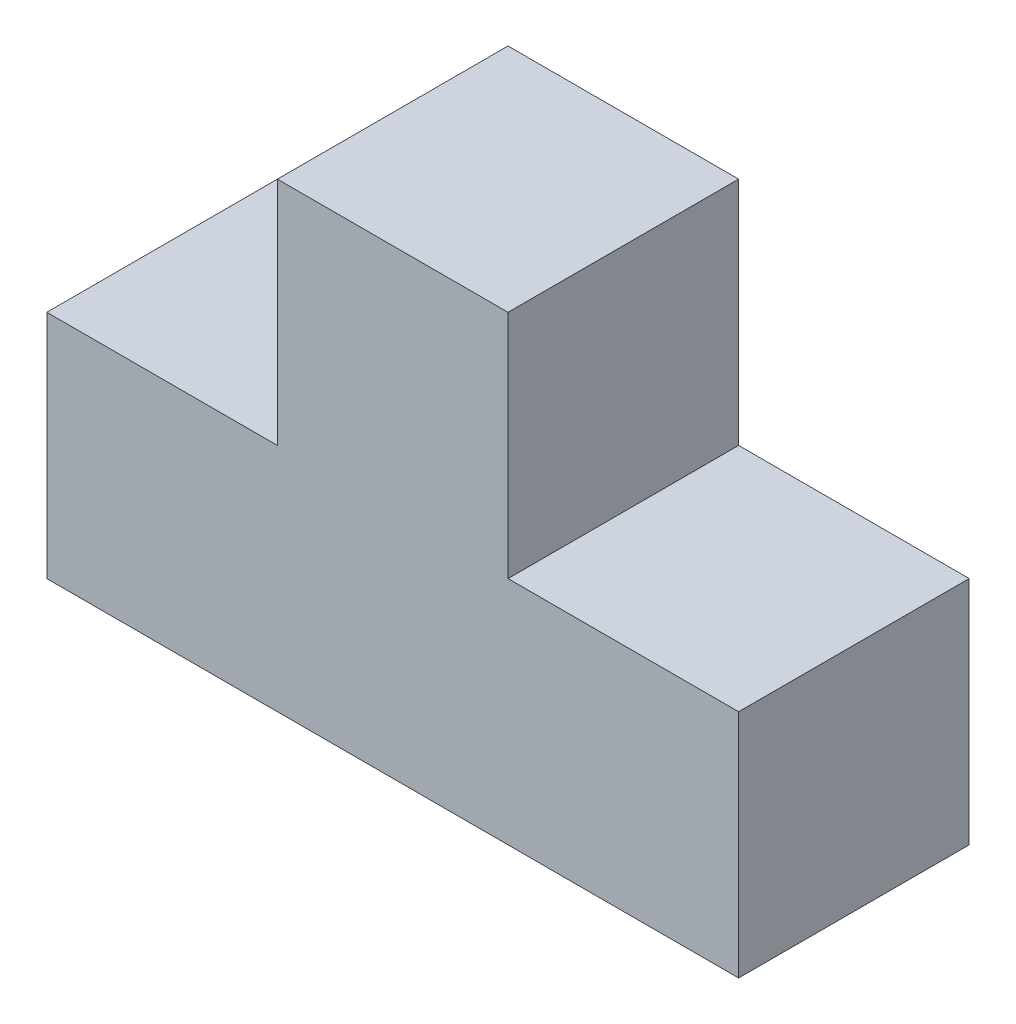
ISO-10303-21;
HEADER;
FILE_DESCRIPTION(('STEP AP214'),'2;1');
FILE_NAME('part.step','',(''),(''),'','','');
FILE_SCHEMA(('AUTOMOTIVE_DESIGN { 1 0 10303 214 1 1 1 1 }'));
ENDSEC;
DATA;
#1=APPLICATION_CONTEXT('core data for automotive mechanical design processes');
#2=APPLICATION_PROTOCOL_DEFINITION('international standard','automotive_design',2000,#1);
#3=PRODUCT_CONTEXT('',#1,'mechanical');
#4=PRODUCT('Part','Part','',(#3));
#5=PRODUCT_RELATED_PRODUCT_CATEGORY('part','',(#4));
#6=PRODUCT_DEFINITION_FORMATION('','',#4);
#7=PRODUCT_DEFINITION_CONTEXT('part definition',#1,'design');
#8=PRODUCT_DEFINITION('design','',#6,#7);
#9=PRODUCT_DEFINITION_SHAPE('','',#8);
#10=(LENGTH_UNIT() NAMED_UNIT(*) SI_UNIT(.MILLI.,.METRE.));
#11=(NAMED_UNIT(*) PLANE_ANGLE_UNIT() SI_UNIT($,.RADIAN.));
#12=(NAMED_UNIT(*) SI_UNIT($,.STERADIAN.) SOLID_ANGLE_UNIT());
#13=UNCERTAINTY_MEASURE_WITH_UNIT(LENGTH_MEASURE(1.E-05),#10,'distance_accuracy_value','');
#14=(GEOMETRIC_REPRESENTATION_CONTEXT(3) GLOBAL_UNCERTAINTY_ASSIGNED_CONTEXT((#13)) GLOBAL_UNIT_ASSIGNED_CONTEXT((#10,
#11,#12)) REPRESENTATION_CONTEXT('',''));
#15=CARTESIAN_POINT('',(0.,0.,0.));
#16=DIRECTION('',(0.,0.,1.));
#17=DIRECTION('',(1.,0.,0.));
#18=AXIS2_PLACEMENT_3D('',#15,#16,#17);
#19=CARTESIAN_POINT('',(0.,30.,30.));
#20=DIRECTION('',(1.,0.,0.));
#21=DIRECTION('',(0.,0.,-1.));
#22=AXIS2_PLACEMENT_3D('',#19,#20,#21);
#23=PLANE('',#22);
#24=DIRECTION('',(0.,-1.,0.));
#25=VECTOR('',#24,1.);
#26=CARTESIAN_POINT('',(0.,30.,0.));
#27=LINE('',#26,#25);
#28=CARTESIAN_POINT('',(0.,30.,0.));
#29=VERTEX_POINT('',#28);
#30=CARTESIAN_POINT('',(0.,0.,0.));
#31=VERTEX_POINT('',#30);
#32=EDGE_CURVE('E129',#29,#31,#27,.T.);
#33=ORIENTED_EDGE('',*,*,#32,.T.);
#34=DIRECTION('',(0.,0.,-1.));
#35=VECTOR('',#34,1.);
#36=CARTESIAN_POINT('',(0.,0.,30.));
#37=LINE('',#36,#35);
#38=CARTESIAN_POINT('',(0.,0.,30.));
#39=VERTEX_POINT('',#38);
#40=EDGE_CURVE('E11',#39,#31,#37,.T.);
#41=ORIENTED_EDGE('',*,*,#40,.F.);
#42=DIRECTION('',(0.,-1.,0.));
#43=VECTOR('',#42,1.);
#44=CARTESIAN_POINT('',(0.,30.,30.));
#45=LINE('',#44,#43);
#46=CARTESIAN_POINT('',(0.,30.,30.));
#47=VERTEX_POINT('',#46);
#48=EDGE_CURVE('E143',#47,#39,#45,.T.);
#49=ORIENTED_EDGE('',*,*,#48,.F.);
#50=DIRECTION('',(0.,0.,-1.));
#51=VECTOR('',#50,1.);
#52=CARTESIAN_POINT('',(0.,30.,30.));
#53=LINE('',#52,#51);
#54=EDGE_CURVE('E125',#47,#29,#53,.T.);
#55=ORIENTED_EDGE('',*,*,#54,.T.);
#56=EDGE_LOOP('',(#33,#41,#49,#55));
#57=FACE_BOUND('',#56,.T.);
#58=ADVANCED_FACE('F33',(#57),#23,.F.);
#59=CARTESIAN_POINT('',(0.,0.,30.));
#60=DIRECTION('',(0.,1.,0.));
#61=DIRECTION('',(0.,0.,1.));
#62=AXIS2_PLACEMENT_3D('',#59,#60,#61);
#63=PLANE('',#62);
#64=DIRECTION('',(1.,0.,0.));
#65=VECTOR('',#64,1.);
#66=CARTESIAN_POINT('',(0.,0.,0.));
#67=LINE('',#66,#65);
#68=CARTESIAN_POINT('',(90.,0.,0.));
#69=VERTEX_POINT('',#68);
#70=EDGE_CURVE('E132',#31,#69,#67,.T.);
#71=ORIENTED_EDGE('',*,*,#70,.T.);
#72=DIRECTION('',(0.,0.,-1.));
#73=VECTOR('',#72,1.);
#74=CARTESIAN_POINT('',(90.,0.,30.));
#75=LINE('',#74,#73);
#76=CARTESIAN_POINT('',(90.,0.,30.));
#77=VERTEX_POINT('',#76);
#78=EDGE_CURVE('E41',#77,#69,#75,.T.);
#79=ORIENTED_EDGE('',*,*,#78,.F.);
#80=DIRECTION('',(1.,0.,0.));
#81=VECTOR('',#80,1.);
#82=CARTESIAN_POINT('',(0.,0.,30.));
#83=LINE('',#82,#81);
#84=EDGE_CURVE('E92',#39,#77,#83,.T.);
#85=ORIENTED_EDGE('',*,*,#84,.F.);
#86=ORIENTED_EDGE('',*,*,#40,.T.);
#87=EDGE_LOOP('',(#71,#79,#85,#86));
#88=FACE_BOUND('',#87,.T.);
#89=ADVANCED_FACE('F178',(#88),#63,.F.);
#90=CARTESIAN_POINT('',(90.,0.,30.));
#91=DIRECTION('',(-1.,0.,0.));
#92=DIRECTION('',(0.,0.,1.));
#93=AXIS2_PLACEMENT_3D('',#90,#91,#92);
#94=PLANE('',#93);
#95=DIRECTION('',(0.,1.,0.));
#96=VECTOR('',#95,1.);
#97=CARTESIAN_POINT('',(90.,0.,0.));
#98=LINE('',#97,#96);
#99=CARTESIAN_POINT('',(90.,30.,0.));
#100=VERTEX_POINT('',#99);
#101=EDGE_CURVE('E134',#69,#100,#98,.T.);
#102=ORIENTED_EDGE('',*,*,#101,.T.);
#103=DIRECTION('',(0.,0.,-1.));
#104=VECTOR('',#103,1.);
#105=CARTESIAN_POINT('',(90.,30.,30.));
#106=LINE('',#105,#104);
#107=CARTESIAN_POINT('',(90.,30.,30.));
#108=VERTEX_POINT('',#107);
#109=EDGE_CURVE('E150',#108,#100,#106,.T.);
#110=ORIENTED_EDGE('',*,*,#109,.F.);
#111=DIRECTION('',(0.,1.,0.));
#112=VECTOR('',#111,1.);
#113=CARTESIAN_POINT('',(90.,0.,30.));
#114=LINE('',#113,#112);
#115=EDGE_CURVE('E158',#77,#108,#114,.T.);
#116=ORIENTED_EDGE('',*,*,#115,.F.);
#117=ORIENTED_EDGE('',*,*,#78,.T.);
#118=EDGE_LOOP('',(#102,#110,#116,#117));
#119=FACE_BOUND('',#118,.T.);
#120=ADVANCED_FACE('F156',(#119),#94,.F.);
#121=CARTESIAN_POINT('',(90.,30.,30.));
#122=DIRECTION('',(0.,-1.,0.));
#123=DIRECTION('',(1.,0.,0.));
#124=AXIS2_PLACEMENT_3D('',#121,#122,#123);
#125=PLANE('',#124);
#126=DIRECTION('',(-1.,0.,0.));
#127=VECTOR('',#126,1.);
#128=CARTESIAN_POINT('',(90.,30.,0.));
#129=LINE('',#128,#127);
#130=CARTESIAN_POINT('',(60.,30.,0.));
#131=VERTEX_POINT('',#130);
#132=EDGE_CURVE('E136',#100,#131,#129,.T.);
#133=ORIENTED_EDGE('',*,*,#132,.T.);
#134=DIRECTION('',(0.,0.,-1.));
#135=VECTOR('',#134,1.);
#136=CARTESIAN_POINT('',(60.,30.,30.));
#137=LINE('',#136,#135);
#138=CARTESIAN_POINT('',(60.,30.,30.));
#139=VERTEX_POINT('',#138);
#140=EDGE_CURVE('E147',#139,#131,#137,.T.);
#141=ORIENTED_EDGE('',*,*,#140,.F.);
#142=DIRECTION('',(-1.,0.,0.));
#143=VECTOR('',#142,1.);
#144=CARTESIAN_POINT('',(90.,30.,30.));
#145=LINE('',#144,#143);
#146=EDGE_CURVE('E170',#108,#139,#145,.T.);
#147=ORIENTED_EDGE('',*,*,#146,.F.);
#148=ORIENTED_EDGE('',*,*,#109,.T.);
#149=EDGE_LOOP('',(#133,#141,#147,#148));
#150=FACE_BOUND('',#149,.T.);
#151=ADVANCED_FACE('F166',(#150),#125,.F.);
#152=CARTESIAN_POINT('',(60.,30.,30.));
#153=DIRECTION('',(-1.,0.,0.));
#154=DIRECTION('',(0.,0.,1.));
#155=AXIS2_PLACEMENT_3D('',#152,#153,#154);
#156=PLANE('',#155);
#157=DIRECTION('',(0.,1.,0.));
#158=VECTOR('',#157,1.);
#159=CARTESIAN_POINT('',(60.,30.,0.));
#160=LINE('',#159,#158);
#161=CARTESIAN_POINT('',(60.,60.,0.));
#162=VERTEX_POINT('',#161);
#163=EDGE_CURVE('E138',#131,#162,#160,.T.);
#164=ORIENTED_EDGE('',*,*,#163,.T.);
#165=DIRECTION('',(0.,0.,-1.));
#166=VECTOR('',#165,1.);
#167=CARTESIAN_POINT('',(60.,60.,30.));
#168=LINE('',#167,#166);
#169=CARTESIAN_POINT('',(60.,60.,30.));
#170=VERTEX_POINT('',#169);
#171=EDGE_CURVE('E120',#170,#162,#168,.T.);
#172=ORIENTED_EDGE('',*,*,#171,.F.);
#173=DIRECTION('',(0.,1.,0.));
#174=VECTOR('',#173,1.);
#175=CARTESIAN_POINT('',(60.,30.,30.));
#176=LINE('',#175,#174);
#177=EDGE_CURVE('E111',#139,#170,#176,.T.);
#178=ORIENTED_EDGE('',*,*,#177,.F.);
#179=ORIENTED_EDGE('',*,*,#140,.T.);
#180=EDGE_LOOP('',(#164,#172,#178,#179));
#181=FACE_BOUND('',#180,.T.);
#182=ADVANCED_FACE('F169',(#181),#156,.F.);
#183=CARTESIAN_POINT('',(60.,60.,30.));
#184=DIRECTION('',(0.,-1.,0.));
#185=DIRECTION('',(1.,0.,0.));
#186=AXIS2_PLACEMENT_3D('',#183,#184,#185);
#187=PLANE('',#186);
#188=DIRECTION('',(-1.,0.,0.));
#189=VECTOR('',#188,1.);
#190=CARTESIAN_POINT('',(60.,60.,0.));
#191=LINE('',#190,#189);
#192=CARTESIAN_POINT('',(30.,60.,0.));
#193=VERTEX_POINT('',#192);
#194=EDGE_CURVE('E119',#162,#193,#191,.T.);
#195=ORIENTED_EDGE('',*,*,#194,.T.);
#196=DIRECTION('',(0.,0.,-1.));
#197=VECTOR('',#196,1.);
#198=CARTESIAN_POINT('',(30.,60.,30.));
#199=LINE('',#198,#197);
#200=CARTESIAN_POINT('',(30.,60.,30.));
#201=VERTEX_POINT('',#200);
#202=EDGE_CURVE('E116',#201,#193,#199,.T.);
#203=ORIENTED_EDGE('',*,*,#202,.F.);
#204=DIRECTION('',(-1.,0.,0.));
#205=VECTOR('',#204,1.);
#206=CARTESIAN_POINT('',(60.,60.,30.));
#207=LINE('',#206,#205);
#208=EDGE_CURVE('E105',#170,#201,#207,.T.);
#209=ORIENTED_EDGE('',*,*,#208,.F.);
#210=ORIENTED_EDGE('',*,*,#171,.T.);
#211=EDGE_LOOP('',(#195,#203,#209,#210));
#212=FACE_BOUND('',#211,.T.);
#213=ADVANCED_FACE('F117',(#212),#187,.F.);
#214=CARTESIAN_POINT('',(30.,60.,30.));
#215=DIRECTION('',(1.,0.,0.));
#216=DIRECTION('',(0.,1.,0.));
#217=AXIS2_PLACEMENT_3D('',#214,#215,#216);
#218=PLANE('',#217);
#219=DIRECTION('',(0.,-1.,0.));
#220=VECTOR('',#219,1.);
#221=CARTESIAN_POINT('',(30.,60.,0.));
#222=LINE('',#221,#220);
#223=CARTESIAN_POINT('',(30.,30.,0.));
#224=VERTEX_POINT('',#223);
#225=EDGE_CURVE('E78',#193,#224,#222,.T.);
#226=ORIENTED_EDGE('',*,*,#225,.T.);
#227=DIRECTION('',(0.,0.,-1.));
#228=VECTOR('',#227,1.);
#229=CARTESIAN_POINT('',(30.,30.,30.));
#230=LINE('',#229,#228);
#231=CARTESIAN_POINT('',(30.,30.,30.));
#232=VERTEX_POINT('',#231);
#233=EDGE_CURVE('E121',#232,#224,#230,.T.);
#234=ORIENTED_EDGE('',*,*,#233,.F.);
#235=DIRECTION('',(0.,-1.,0.));
#236=VECTOR('',#235,1.);
#237=CARTESIAN_POINT('',(30.,60.,30.));
#238=LINE('',#237,#236);
#239=EDGE_CURVE('E109',#201,#232,#238,.T.);
#240=ORIENTED_EDGE('',*,*,#239,.F.);
#241=ORIENTED_EDGE('',*,*,#202,.T.);
#242=EDGE_LOOP('',(#226,#234,#240,#241));
#243=FACE_BOUND('',#242,.T.);
#244=ADVANCED_FACE('F123',(#243),#218,.F.);
#245=CARTESIAN_POINT('',(30.,30.,30.));
#246=DIRECTION('',(0.,-1.,0.));
#247=DIRECTION('',(1.,0.,0.));
#248=AXIS2_PLACEMENT_3D('',#245,#246,#247);
#249=PLANE('',#248);
#250=DIRECTION('',(-1.,0.,0.));
#251=VECTOR('',#250,1.);
#252=CARTESIAN_POINT('',(30.,30.,0.));
#253=LINE('',#252,#251);
#254=EDGE_CURVE('E84',#224,#29,#253,.T.);
#255=ORIENTED_EDGE('',*,*,#254,.T.);
#256=ORIENTED_EDGE('',*,*,#54,.F.);
#257=DIRECTION('',(-1.,0.,0.));
#258=VECTOR('',#257,1.);
#259=CARTESIAN_POINT('',(30.,30.,30.));
#260=LINE('',#259,#258);
#261=EDGE_CURVE('E49',#232,#47,#260,.T.);
#262=ORIENTED_EDGE('',*,*,#261,.F.);
#263=ORIENTED_EDGE('',*,*,#233,.T.);
#264=EDGE_LOOP('',(#255,#256,#262,#263));
#265=FACE_BOUND('',#264,.T.);
#266=ADVANCED_FACE('F194',(#265),#249,.F.);
#267=CARTESIAN_POINT('',(0.,0.,30.));
#268=DIRECTION('',(0.,0.,1.));
#269=DIRECTION('',(1.,0.,0.));
#270=AXIS2_PLACEMENT_3D('',#267,#268,#269);
#271=PLANE('',#270);
#272=ORIENTED_EDGE('',*,*,#48,.T.);
#273=ORIENTED_EDGE('',*,*,#84,.T.);
#274=ORIENTED_EDGE('',*,*,#115,.T.);
#275=ORIENTED_EDGE('',*,*,#146,.T.);
#276=ORIENTED_EDGE('',*,*,#177,.T.);
#277=ORIENTED_EDGE('',*,*,#208,.T.);
#278=ORIENTED_EDGE('',*,*,#239,.T.);
#279=ORIENTED_EDGE('',*,*,#261,.T.);
#280=EDGE_LOOP('',(#272,#273,#274,#275,#276,#277,#278,#279));
#281=FACE_BOUND('',#280,.T.);
#282=ADVANCED_FACE('F107',(#281),#271,.T.);
#283=CARTESIAN_POINT('',(0.,0.,0.));
#284=DIRECTION('',(0.,0.,1.));
#285=DIRECTION('',(1.,0.,0.));
#286=AXIS2_PLACEMENT_3D('',#283,#284,#285);
#287=PLANE('',#286);
#288=ORIENTED_EDGE('',*,*,#32,.F.);
#289=ORIENTED_EDGE('',*,*,#254,.F.);
#290=ORIENTED_EDGE('',*,*,#225,.F.);
#291=ORIENTED_EDGE('',*,*,#194,.F.);
#292=ORIENTED_EDGE('',*,*,#163,.F.);
#293=ORIENTED_EDGE('',*,*,#132,.F.);
#294=ORIENTED_EDGE('',*,*,#101,.F.);
#295=ORIENTED_EDGE('',*,*,#70,.F.);
#296=EDGE_LOOP('',(#288,#289,#290,#291,#292,#293,#294,#295));
#297=FACE_BOUND('',#296,.T.);
#298=ADVANCED_FACE('F162',(#297),#287,.F.);
#299=CLOSED_SHELL('',(#58,#89,#120,#151,#182,#213,#244,#266,#282,#298));
#300=MANIFOLD_SOLID_BREP('B2',#299);
#301=ADVANCED_BREP_SHAPE_REPRESENTATION('',(#18,#300),#14);
#302=SHAPE_DEFINITION_REPRESENTATION(#9,#301);
ENDSEC;
END-ISO-10303-21;
